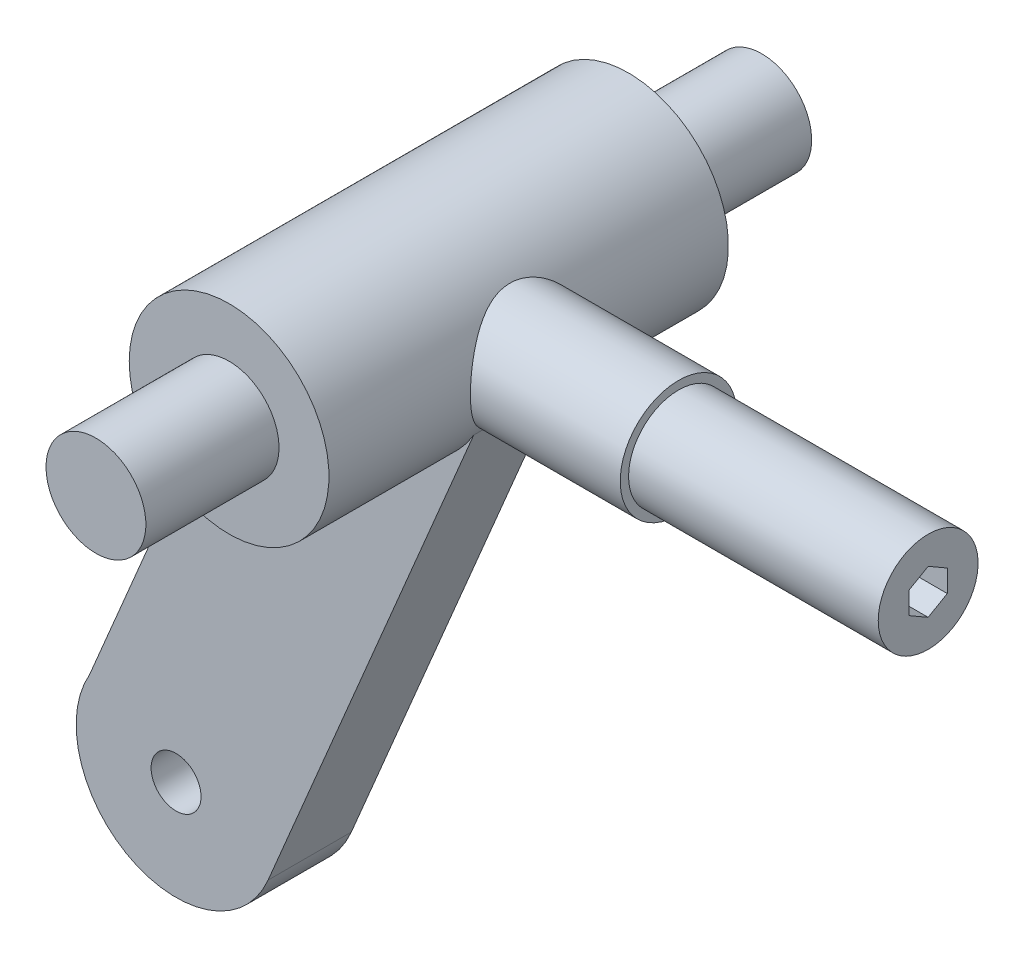
ISO-10303-21;
HEADER;
FILE_DESCRIPTION(('STEP AP214'),'2;1');
FILE_NAME('part.step','',(''),(''),'','','');
FILE_SCHEMA(('AUTOMOTIVE_DESIGN { 1 0 10303 214 1 1 1 1 }'));
ENDSEC;
DATA;
#1=APPLICATION_CONTEXT('core data for automotive mechanical design processes');
#2=APPLICATION_PROTOCOL_DEFINITION('international standard','automotive_design',2000,#1);
#3=PRODUCT_CONTEXT('',#1,'mechanical');
#4=PRODUCT('Part','Part','',(#3));
#5=PRODUCT_RELATED_PRODUCT_CATEGORY('part','',(#4));
#6=PRODUCT_DEFINITION_FORMATION('','',#4);
#7=PRODUCT_DEFINITION_CONTEXT('part definition',#1,'design');
#8=PRODUCT_DEFINITION('design','',#6,#7);
#9=PRODUCT_DEFINITION_SHAPE('','',#8);
#10=(LENGTH_UNIT() NAMED_UNIT(*) SI_UNIT(.MILLI.,.METRE.));
#11=(NAMED_UNIT(*) PLANE_ANGLE_UNIT() SI_UNIT($,.RADIAN.));
#12=(NAMED_UNIT(*) SI_UNIT($,.STERADIAN.) SOLID_ANGLE_UNIT());
#13=UNCERTAINTY_MEASURE_WITH_UNIT(LENGTH_MEASURE(1.E-05),#10,'distance_accuracy_value','');
#14=(GEOMETRIC_REPRESENTATION_CONTEXT(3) GLOBAL_UNCERTAINTY_ASSIGNED_CONTEXT((#13)) GLOBAL_UNIT_ASSIGNED_CONTEXT((#10,
#11,#12)) REPRESENTATION_CONTEXT('',''));
#15=CARTESIAN_POINT('',(0.,0.,0.));
#16=DIRECTION('',(0.,0.,1.));
#17=DIRECTION('',(1.,0.,0.));
#18=AXIS2_PLACEMENT_3D('',#15,#16,#17);
#19=CARTESIAN_POINT('',(3.31138823368356,0.,0.));
#20=DIRECTION('',(-1.,0.,0.));
#21=DIRECTION('',(0.,0.,1.));
#22=AXIS2_PLACEMENT_3D('',#19,#20,#21);
#23=CYLINDRICAL_SURFACE('',#22,3.);
#24=CARTESIAN_POINT('',(0.,0.,0.));
#25=DIRECTION('',(-1.,0.,0.));
#26=DIRECTION('',(0.,0.,1.));
#27=AXIS2_PLACEMENT_3D('',#24,#25,#26);
#28=CIRCLE('',#27,3.);
#29=CARTESIAN_POINT('',(0.,0.,3.));
#30=VERTEX_POINT('',#29);
#31=EDGE_CURVE('E11',#30,#30,#28,.T.);
#32=ORIENTED_EDGE('',*,*,#31,.F.);
#33=EDGE_LOOP('',(#32));
#34=FACE_BOUND('',#33,.T.);
#35=CARTESIAN_POINT('',(2.99999999999994,0.,0.));
#36=DIRECTION('',(-1.,0.,0.));
#37=DIRECTION('',(0.,0.,1.));
#38=AXIS2_PLACEMENT_3D('',#35,#36,#37);
#39=CIRCLE('',#38,3.);
#40=CARTESIAN_POINT('',(2.99999999999994,0.,3.));
#41=VERTEX_POINT('',#40);
#42=EDGE_CURVE('E55',#41,#41,#39,.T.);
#43=ORIENTED_EDGE('',*,*,#42,.T.);
#44=EDGE_LOOP('',(#43));
#45=FACE_BOUND('',#44,.T.);
#46=ADVANCED_FACE('F49',(#34,#45),#23,.T.);
#47=CARTESIAN_POINT('',(0.,0.,0.));
#48=DIRECTION('',(1.,0.,0.));
#49=DIRECTION('',(0.,0.,-1.));
#50=AXIS2_PLACEMENT_3D('',#47,#48,#49);
#51=PLANE('',#50);
#52=ORIENTED_EDGE('',*,*,#31,.T.);
#53=EDGE_LOOP('',(#52));
#54=FACE_BOUND('',#53,.T.);
#55=ADVANCED_FACE('F64',(#54),#51,.F.);
#56=CARTESIAN_POINT('',(2.99999999999996,0.,0.));
#57=DIRECTION('',(1.,0.,0.));
#58=DIRECTION('',(0.,0.,-1.));
#59=AXIS2_PLACEMENT_3D('',#56,#57,#58);
#60=PLANE('',#59);
#61=ORIENTED_EDGE('',*,*,#42,.F.);
#62=EDGE_LOOP('',(#61));
#63=FACE_BOUND('',#62,.T.);
#64=ADVANCED_FACE('F62',(#63),#60,.T.);
#65=CLOSED_SHELL('',(#46,#55,#64));
#66=MANIFOLD_SOLID_BREP('B2',#65);
#67=CARTESIAN_POINT('',(30.,0.,0.));
#68=DIRECTION('',(1.,0.,0.));
#69=DIRECTION('',(0.,0.,-1.));
#70=AXIS2_PLACEMENT_3D('',#67,#68,#69);
#71=PLANE('',#70);
#72=CARTESIAN_POINT('',(30.,0.,0.));
#73=DIRECTION('',(-1.,0.,0.));
#74=DIRECTION('',(0.,0.,1.));
#75=AXIS2_PLACEMENT_3D('',#72,#73,#74);
#76=CIRCLE('',#75,3.);
#77=CARTESIAN_POINT('',(30.,0.,3.));
#78=VERTEX_POINT('',#77);
#79=EDGE_CURVE('E242',#78,#78,#76,.T.);
#80=ORIENTED_EDGE('',*,*,#79,.F.);
#81=EDGE_LOOP('',(#80));
#82=FACE_BOUND('',#81,.T.);
#83=DIRECTION('',(0.,0.5,0.866025403784439));
#84=VECTOR('',#83,1.);
#85=CARTESIAN_POINT('',(30.,0.995207119104028,-0.574583098114143));
#86=LINE('',#85,#84);
#87=CARTESIAN_POINT('',(30.,0.663471412736019,-1.14916619622829));
#88=VERTEX_POINT('',#87);
#89=CARTESIAN_POINT('',(30.,1.32694282547204,0.));
#90=VERTEX_POINT('',#89);
#91=EDGE_CURVE('E251',#88,#90,#86,.T.);
#92=ORIENTED_EDGE('',*,*,#91,.F.);
#93=DIRECTION('',(0.,1.,0.));
#94=VECTOR('',#93,1.);
#95=CARTESIAN_POINT('',(30.,0.,-1.14916619622829));
#96=LINE('',#95,#94);
#97=CARTESIAN_POINT('',(30.,-0.663471412736019,-1.14916619622829));
#98=VERTEX_POINT('',#97);
#99=EDGE_CURVE('E255',#98,#88,#96,.T.);
#100=ORIENTED_EDGE('',*,*,#99,.F.);
#101=DIRECTION('',(0.,0.5,-0.866025403784439));
#102=VECTOR('',#101,1.);
#103=CARTESIAN_POINT('',(30.,-0.995207119104029,-0.574583098114143));
#104=LINE('',#103,#102);
#105=CARTESIAN_POINT('',(30.,-1.32694282547204,0.));
#106=VERTEX_POINT('',#105);
#107=EDGE_CURVE('E215',#106,#98,#104,.T.);
#108=ORIENTED_EDGE('',*,*,#107,.F.);
#109=DIRECTION('',(0.,-0.5,-0.866025403784439));
#110=VECTOR('',#109,1.);
#111=CARTESIAN_POINT('',(30.,-0.995207119104028,0.574583098114142));
#112=LINE('',#111,#110);
#113=CARTESIAN_POINT('',(30.,-0.663471412736018,1.14916619622829));
#114=VERTEX_POINT('',#113);
#115=EDGE_CURVE('E113',#114,#106,#112,.T.);
#116=ORIENTED_EDGE('',*,*,#115,.F.);
#117=DIRECTION('',(0.,-1.,0.));
#118=VECTOR('',#117,1.);
#119=CARTESIAN_POINT('',(30.,0.,1.14916619622829));
#120=LINE('',#119,#118);
#121=CARTESIAN_POINT('',(30.,0.663471412736019,1.14916619622828));
#122=VERTEX_POINT('',#121);
#123=EDGE_CURVE('E243',#122,#114,#120,.T.);
#124=ORIENTED_EDGE('',*,*,#123,.F.);
#125=DIRECTION('',(0.,-0.5,0.866025403784439));
#126=VECTOR('',#125,1.);
#127=CARTESIAN_POINT('',(30.,0.995207119104028,0.574583098114143));
#128=LINE('',#127,#126);
#129=EDGE_CURVE('E247',#90,#122,#128,.T.);
#130=ORIENTED_EDGE('',*,*,#129,.F.);
#131=EDGE_LOOP('',(#92,#100,#108,#116,#124,#130));
#132=FACE_BOUND('',#131,.T.);
#133=ADVANCED_FACE('F90',(#82,#132),#71,.T.);
#134=CARTESIAN_POINT('',(0.,0.,-20.));
#135=DIRECTION('',(0.,0.,-1.));
#136=DIRECTION('',(-1.,0.,0.));
#137=AXIS2_PLACEMENT_3D('',#134,#135,#136);
#138=CYLINDRICAL_SURFACE('',#137,5.99999999999997);
#139=DIRECTION('',(0.,0.,-1.));
#140=VECTOR('',#139,1.);
#141=CARTESIAN_POINT('',(5.19878742225396,-2.99543141103468,2.5));
#142=LINE('',#141,#140);
#143=CARTESIAN_POINT('',(5.19878742225396,-2.99543141103468,2.5));
#144=VERTEX_POINT('',#143);
#145=CARTESIAN_POINT('',(5.19878742225396,-2.99543141103468,1.81035650129658));
#146=VERTEX_POINT('',#145);
#147=EDGE_CURVE('E207',#144,#146,#142,.T.);
#148=ORIENTED_EDGE('',*,*,#147,.T.);
#149=CARTESIAN_POINT('',(5.99999999999997,0.,3.5));
#150=CARTESIAN_POINT('',(5.99999940705529,0.0899621842017,3.499999344979));
#151=CARTESIAN_POINT('',(5.99797113274333,0.179959123472136,3.49652549070914));
#152=CARTESIAN_POINT('',(5.9899069974074,0.359279181505375,3.48267375145587));
#153=CARTESIAN_POINT('',(5.98386839889509,0.448601797816938,3.47229115048177));
#154=CARTESIAN_POINT('',(5.96791503780682,0.626048243263435,3.44472607587532));
#155=CARTESIAN_POINT('',(5.95799184607169,0.714169031319306,3.42752881414367));
#156=CARTESIAN_POINT('',(5.93451883712603,0.888388196147667,3.38656029192718));
#157=CARTESIAN_POINT('',(5.92096745701799,0.974485683925672,3.36278619822453));
#158=CARTESIAN_POINT('',(5.87549044108278,1.22795193693791,3.28228254868244));
#159=CARTESIAN_POINT('',(5.83863857796368,1.39157911080687,3.21619899902307));
#160=CARTESIAN_POINT('',(5.75498500284208,1.70485306237609,3.06170731941832));
#161=CARTESIAN_POINT('',(5.70818668937317,1.85450459024161,2.97330681286644));
#162=CARTESIAN_POINT('',(5.60455210541235,2.14825204388916,2.76934942490433));
#163=CARTESIAN_POINT('',(5.54722907494984,2.29111541335043,2.65226606318091));
#164=CARTESIAN_POINT('',(5.43010305440727,2.55637666788825,2.39766667401416));
#165=CARTESIAN_POINT('',(5.37029705995943,2.67874880147822,2.26012534051895));
#166=CARTESIAN_POINT('',(5.24687865780901,2.91372645980217,1.9499418739621));
#167=CARTESIAN_POINT('',(5.18361328174861,3.023613987063,1.77508434232938));
#168=CARTESIAN_POINT('',(5.06905701564851,3.21198955709959,1.40567797214929));
#169=CARTESIAN_POINT('',(5.01774741841727,3.29052679284978,1.21116058858183));
#170=CARTESIAN_POINT('',(4.94524723148705,3.3981959438312,0.853622661771461));
#171=CARTESIAN_POINT('',(4.91984581185323,3.43453185280106,0.693627748220048));
#172=CARTESIAN_POINT('',(4.88464999348728,3.48441762747016,0.368510773523086));
#173=CARTESIAN_POINT('',(4.87483780508291,3.4979934668325,0.203394776092037));
#174=CARTESIAN_POINT('',(4.87225207387584,3.50159501400216,-0.127492341510743));
#175=CARTESIAN_POINT('',(4.87950571853601,3.49158314435522,-0.293264086437549));
#176=CARTESIAN_POINT('',(4.91001053927532,3.44854447624329,-0.620316048718743));
#177=CARTESIAN_POINT('',(4.93327315695059,3.41550121705183,-0.781592967793281));
#178=CARTESIAN_POINT('',(4.99243522012915,3.32840818064217,-1.09448992259878));
#179=CARTESIAN_POINT('',(5.02824040676163,3.27451478757804,-1.24617229202273));
#180=CARTESIAN_POINT('',(5.10862226659791,3.14763556587526,-1.53878459523282));
#181=CARTESIAN_POINT('',(5.15320223753607,3.07464255582214,-1.67971045879673));
#182=CARTESIAN_POINT('',(5.25508726886632,2.89760539824611,-1.97171937004038));
#183=CARTESIAN_POINT('',(5.31327541003331,2.7904154385322,-2.12059046379416));
#184=CARTESIAN_POINT('',(5.43069826274642,2.55439792135507,-2.39969384846331));
#185=CARTESIAN_POINT('',(5.48993387059697,2.42555094218621,-2.52990921328398));
#186=CARTESIAN_POINT('',(5.61148764416559,2.13062710418621,-2.78438595496094));
#187=CARTESIAN_POINT('',(5.67327691399839,1.96191474322218,-2.90590577058856));
#188=CARTESIAN_POINT('',(5.75704001227156,1.69274613625395,-3.06521152036507));
#189=CARTESIAN_POINT('',(5.78348329258611,1.60029853664454,-3.11449999867862));
#190=CARTESIAN_POINT('',(5.83265675908537,1.41056352156909,-3.20489156149222));
#191=CARTESIAN_POINT('',(5.85538921272543,1.31327910935178,-3.24599964791056));
#192=CARTESIAN_POINT('',(5.89507604633967,1.12118402811537,-3.31703609991152));
#193=CARTESIAN_POINT('',(5.91231421426123,1.02663935486808,-3.34752628148385));
#194=CARTESIAN_POINT('',(5.94244994910543,0.834695284408387,-3.40046848495027));
#195=CARTESIAN_POINT('',(5.95534989234229,0.73729748192204,-3.42292490786274));
#196=CARTESIAN_POINT('',(5.97642417050808,0.540500524879281,-3.45946074437019));
#197=CARTESIAN_POINT('',(5.98460150264117,0.441102681196741,-3.47354547122639));
#198=CARTESIAN_POINT('',(5.99598613235846,0.241187521473643,-3.49312375299983));
#199=CARTESIAN_POINT('',(5.99919404224351,0.140670344887641,-3.49861836633743));
#200=CARTESIAN_POINT('',(6.00045229485499,-0.0476500287328541,-3.50077534614502));
#201=CARTESIAN_POINT('',(5.99910862745505,-0.13543859084843,-3.49847544179336));
#202=CARTESIAN_POINT('',(5.99260403927111,-0.310461993330533,-3.48730817050794));
#203=CARTESIAN_POINT('',(5.98744193105941,-0.397696652936138,-3.47843876064159));
#204=CARTESIAN_POINT('',(5.96638262286712,-0.657520099512271,-3.44211487885189));
#205=CARTESIAN_POINT('',(5.94491336191049,-0.828422689977253,-3.40494664647616));
#206=CARTESIAN_POINT('',(5.88951843760437,-1.15808876666691,-3.30726440057742));
#207=CARTESIAN_POINT('',(5.85579439314151,-1.31700110317443,-3.24712749885318));
#208=CARTESIAN_POINT('',(5.77859485954364,-1.62255442838772,-3.10574691200883));
#209=CARTESIAN_POINT('',(5.73511720898609,-1.76919268722312,-3.0244985479054));
#210=CARTESIAN_POINT('',(5.63670505849234,-2.0625033084342,-2.8336931482093));
#211=CARTESIAN_POINT('',(5.58104858397802,-2.20758407137201,-2.72206739494686));
#212=CARTESIAN_POINT('',(5.46632933394453,-2.47807930325939,-2.47837093630279));
#213=CARTESIAN_POINT('',(5.40726264985702,-2.60347056780367,-2.34627646692488));
#214=CARTESIAN_POINT('',(5.28383495589227,-2.8463608155606,-2.04687887108909));
#215=CARTESIAN_POINT('',(5.21968488278057,-2.96112553039477,-1.87725460200967));
#216=CARTESIAN_POINT('',(5.10151027475491,-3.16038820338437,-1.51789928053921));
#217=CARTESIAN_POINT('',(5.04747329459452,-3.24492348040676,-1.32819339710366));
#218=CARTESIAN_POINT('',(4.96776744065975,-3.36531429748044,-0.975452204253678));
#219=CARTESIAN_POINT('',(4.93849487756631,-3.40773412765483,-0.815477783475593));
#220=CARTESIAN_POINT('',(4.89523317923759,-3.46960492167826,-0.489209064892347));
#221=CARTESIAN_POINT('',(4.88122503179366,-3.489084460678,-0.322922896423289));
#222=CARTESIAN_POINT('',(4.87053514207995,-3.50399594756399,0.0117532202430811));
#223=CARTESIAN_POINT('',(4.87389986973789,-3.49936339883644,0.180147607673535));
#224=CARTESIAN_POINT('',(4.89753765573743,-3.46619534757535,0.513387819359799));
#225=CARTESIAN_POINT('',(4.9178210182451,-3.43764527821144,0.678231418256455));
#226=CARTESIAN_POINT('',(4.97157869971421,-3.35939658034854,0.995161348999715));
#227=CARTESIAN_POINT('',(5.00464806903075,-3.31034376760202,1.14748017565883));
#228=CARTESIAN_POINT('',(5.08026146937035,-3.19308606788782,1.44199861353434));
#229=CARTESIAN_POINT('',(5.12280908648054,-3.12487392945044,1.58419436775333));
#230=CARTESIAN_POINT('',(5.22059857811579,-2.95904753922134,1.87795620125289));
#231=CARTESIAN_POINT('',(5.27678588540068,-2.8585152484814,2.02756049479071));
#232=CARTESIAN_POINT('',(5.39128042536149,-2.6362423687887,2.30921697519904));
#233=CARTESIAN_POINT('',(5.44958929089823,-2.51448515863008,2.44125526220363));
#234=CARTESIAN_POINT('',(5.57143917603492,-2.23286219445597,2.70299413509765));
#235=CARTESIAN_POINT('',(5.63456802501056,-2.07004703111803,2.82977305151313));
#236=CARTESIAN_POINT('',(5.72147203378951,-1.80920666729131,2.9979192430271));
#237=CARTESIAN_POINT('',(5.74916078272631,-1.71941205496245,3.05033058248405));
#238=CARTESIAN_POINT('',(5.80117891858138,-1.53476261972516,3.14727760192881));
#239=CARTESIAN_POINT('',(5.82551026170157,-1.43991078846993,3.19181787230002));
#240=CARTESIAN_POINT('',(5.86904784303835,-1.25031817720424,3.27058817523678));
#241=CARTESIAN_POINT('',(5.88844069632124,-1.15578010730153,3.30520328441334));
#242=CARTESIAN_POINT('',(5.92295472951738,-0.963403250723181,3.36630793151273));
#243=CARTESIAN_POINT('',(5.93807839302153,-0.865566420334712,3.39280219449155));
#244=CARTESIAN_POINT('',(5.96356695531814,-0.667677878357174,3.43721698560877));
#245=CARTESIAN_POINT('',(5.97394622618967,-0.56763383139994,3.45516341453391));
#246=CARTESIAN_POINT('',(5.98967652486907,-0.366031363492469,3.4822906809512));
#247=CARTESIAN_POINT('',(5.9950320468426,-0.264474378789174,3.49147935311125));
#248=CARTESIAN_POINT('',(5.9985289781034,-0.1356008428426,3.49747764565677));
#249=CARTESIAN_POINT('',(5.99908033765354,-0.108493391182496,3.4984232282245));
#250=CARTESIAN_POINT('',(5.99981593957895,-0.0542583467885981,3.49968450685542));
#251=CARTESIAN_POINT('',(6.00000017881996,-0.0271307538848262,3.50000019754093));
#252=CARTESIAN_POINT('',(5.99999999999997,0.,3.5));
#253=B_SPLINE_CURVE_WITH_KNOTS('',3,(#149,#150,#151,#152,#153,#154,#155,#156,#157,#158,#159,
#160,#161,#162,#163,#164,#165,#166,#167,#168,#169,#170,#171,#172,#173,#174,#175,#176,#177,#178,
#179,#180,#181,#182,#183,#184,#185,#186,#187,#188,#189,#190,#191,#192,#193,#194,#195,#196,#197,
#198,#199,#200,#201,#202,#203,#204,#205,#206,#207,#208,#209,#210,#211,#212,#213,#214,#215,#216,
#217,#218,#219,#220,#221,#222,#223,#224,#225,#226,#227,#228,#229,#230,#231,#232,#233,#234,#235,
#236,#237,#238,#239,#240,#241,#242,#243,#244,#245,#246,#247,#248,#249,#250,#251,#252),
.UNSPECIFIED.,.T.,.F.,(4,2,2,2,2,2,2,2,2,2,2,2,2,2,2,2,2,2,2,2,2,2,2,2,2,2,2,2,2,2,2,2,2,2,2,2,
2,2,2,2,2,2,2,2,2,2,2,2,2,2,2,4),(0.,0.269857022230553,0.539898441223979,0.81052909898963,
1.08127652312956,1.61950432452768,2.15754851740577,2.73544583741866,3.31406404167448,
3.9588634393916,4.60264704184033,5.09858348127047,5.59395357461926,6.09011337294359,
6.58662814492186,7.07948888602377,7.57253520864788,8.14762469114194,8.72323268451362,
9.37023224992073,9.69399877078183,10.0175667114708,10.3196086145674,10.6214848001053,
10.9231691888501,11.2248164029905,11.4879654567385,11.7511963768611,12.2770829521784,
12.7946826161502,13.3123970949539,13.8841084077748,14.4564885153885,15.0972759394319,
15.7372695446949,16.2393630156573,16.7408303993928,17.2436398295978,17.746755715859,
18.2350938681074,18.7236170974388,19.2878323305451,19.852491401133,20.4962952131074,
20.8187115384657,21.1409392065765,21.4480807758936,21.7550432963678,22.0610696775496,
22.3668220305958,22.4482046916946,22.5295880475924),.UNSPECIFIED.);
#254=CARTESIAN_POINT('',(5.198787422254,-2.99543141103469,-1.81035650129657));
#255=VERTEX_POINT('',#254);
#256=EDGE_CURVE('E280',#146,#255,#253,.T.);
#257=ORIENTED_EDGE('',*,*,#256,.T.);
#258=CARTESIAN_POINT('',(5.19878742225396,-2.99543141103468,-2.5));
#259=VERTEX_POINT('',#258);
#260=EDGE_CURVE('E106',#255,#259,#142,.T.);
#261=ORIENTED_EDGE('',*,*,#260,.T.);
#262=CARTESIAN_POINT('',(0.,0.,-2.5));
#263=DIRECTION('',(0.,0.,1.));
#264=DIRECTION('',(1.,0.,0.));
#265=AXIS2_PLACEMENT_3D('',#262,#263,#264);
#266=CIRCLE('',#265,5.99999999999993);
#267=CARTESIAN_POINT('',(-5.52947005879516,2.32915453950291,-2.5));
#268=VERTEX_POINT('',#267);
#269=EDGE_CURVE('E517',#268,#259,#266,.T.);
#270=ORIENTED_EDGE('',*,*,#269,.F.);
#271=DIRECTION('',(0.,0.,-1.));
#272=VECTOR('',#271,1.);
#273=CARTESIAN_POINT('',(-5.52947005879516,2.32915453950291,2.5));
#274=LINE('',#273,#272);
#275=CARTESIAN_POINT('',(-5.52947005879516,2.32915453950291,2.5));
#276=VERTEX_POINT('',#275);
#277=EDGE_CURVE('E528',#276,#268,#274,.T.);
#278=ORIENTED_EDGE('',*,*,#277,.F.);
#279=CARTESIAN_POINT('',(0.,0.,2.5));
#280=DIRECTION('',(0.,0.,1.));
#281=DIRECTION('',(1.,0.,0.));
#282=AXIS2_PLACEMENT_3D('',#279,#280,#281);
#283=CIRCLE('',#282,5.99999999999993);
#284=EDGE_CURVE('E191',#276,#144,#283,.T.);
#285=ORIENTED_EDGE('',*,*,#284,.T.);
#286=EDGE_LOOP('',(#148,#257,#261,#270,#278,#285));
#287=FACE_BOUND('',#286,.T.);
#288=CARTESIAN_POINT('',(0.,0.,-12.));
#289=DIRECTION('',(0.,0.,-1.));
#290=DIRECTION('',(-1.,0.,0.));
#291=AXIS2_PLACEMENT_3D('',#288,#289,#290);
#292=CIRCLE('',#291,6.);
#293=CARTESIAN_POINT('',(-6.00000000000001,0.,-12.));
#294=VERTEX_POINT('',#293);
#295=EDGE_CURVE('E297',#294,#294,#292,.T.);
#296=ORIENTED_EDGE('',*,*,#295,.F.);
#297=EDGE_LOOP('',(#296));
#298=FACE_BOUND('',#297,.T.);
#299=CARTESIAN_POINT('',(0.,0.,12.));
#300=DIRECTION('',(0.,0.,-1.));
#301=DIRECTION('',(-1.,0.,0.));
#302=AXIS2_PLACEMENT_3D('',#299,#300,#301);
#303=CIRCLE('',#302,5.99999999999994);
#304=CARTESIAN_POINT('',(-5.99999999999994,0.,12.));
#305=VERTEX_POINT('',#304);
#306=EDGE_CURVE('E99',#305,#305,#303,.T.);
#307=ORIENTED_EDGE('',*,*,#306,.T.);
#308=EDGE_LOOP('',(#307));
#309=FACE_BOUND('',#308,.T.);
#310=ADVANCED_FACE('F310',(#287,#298,#309),#138,.T.);
#311=CARTESIAN_POINT('',(0.,0.,12.));
#312=DIRECTION('',(0.,0.,-1.));
#313=DIRECTION('',(-1.,0.,0.));
#314=AXIS2_PLACEMENT_3D('',#311,#312,#313);
#315=PLANE('',#314);
#316=ORIENTED_EDGE('',*,*,#306,.F.);
#317=EDGE_LOOP('',(#316));
#318=FACE_BOUND('',#317,.T.);
#319=CARTESIAN_POINT('',(0.,0.,12.));
#320=DIRECTION('',(0.,0.,-1.));
#321=DIRECTION('',(-1.,0.,0.));
#322=AXIS2_PLACEMENT_3D('',#319,#320,#321);
#323=CIRCLE('',#322,2.99999999999998);
#324=CARTESIAN_POINT('',(-2.99999999999998,0.,12.));
#325=VERTEX_POINT('',#324);
#326=EDGE_CURVE('E281',#325,#325,#323,.T.);
#327=ORIENTED_EDGE('',*,*,#326,.T.);
#328=EDGE_LOOP('',(#327));
#329=FACE_BOUND('',#328,.T.);
#330=ADVANCED_FACE('F92',(#318,#329),#315,.F.);
#331=CARTESIAN_POINT('',(0.,0.,-12.));
#332=DIRECTION('',(0.,0.,-1.));
#333=DIRECTION('',(-1.,0.,0.));
#334=AXIS2_PLACEMENT_3D('',#331,#332,#333);
#335=PLANE('',#334);
#336=ORIENTED_EDGE('',*,*,#295,.T.);
#337=EDGE_LOOP('',(#336));
#338=FACE_BOUND('',#337,.T.);
#339=CARTESIAN_POINT('',(0.,0.,-12.));
#340=DIRECTION('',(0.,0.,-1.));
#341=DIRECTION('',(-1.,0.,0.));
#342=AXIS2_PLACEMENT_3D('',#339,#340,#341);
#343=CIRCLE('',#342,2.99999999999998);
#344=CARTESIAN_POINT('',(-2.99999999999998,0.,-12.));
#345=VERTEX_POINT('',#344);
#346=EDGE_CURVE('E293',#345,#345,#343,.T.);
#347=ORIENTED_EDGE('',*,*,#346,.F.);
#348=EDGE_LOOP('',(#347));
#349=FACE_BOUND('',#348,.T.);
#350=ADVANCED_FACE('F335',(#338,#349),#335,.T.);
#351=CARTESIAN_POINT('',(0.,0.,-20.));
#352=DIRECTION('',(0.,0.,-1.));
#353=DIRECTION('',(-1.,0.,0.));
#354=AXIS2_PLACEMENT_3D('',#351,#352,#353);
#355=CYLINDRICAL_SURFACE('',#354,2.99999999999999);
#356=CARTESIAN_POINT('',(0.,0.,-20.));
#357=DIRECTION('',(0.,0.,-1.));
#358=DIRECTION('',(-1.,0.,0.));
#359=AXIS2_PLACEMENT_3D('',#356,#357,#358);
#360=CIRCLE('',#359,3.);
#361=CARTESIAN_POINT('',(-3.00000000000001,0.,-20.));
#362=VERTEX_POINT('',#361);
#363=EDGE_CURVE('E289',#362,#362,#360,.T.);
#364=ORIENTED_EDGE('',*,*,#363,.F.);
#365=EDGE_LOOP('',(#364));
#366=FACE_BOUND('',#365,.T.);
#367=ORIENTED_EDGE('',*,*,#346,.T.);
#368=EDGE_LOOP('',(#367));
#369=FACE_BOUND('',#368,.T.);
#370=ADVANCED_FACE('F332',(#366,#369),#355,.T.);
#371=CARTESIAN_POINT('',(0.,0.,-20.));
#372=DIRECTION('',(0.,0.,1.));
#373=DIRECTION('',(1.,0.,0.));
#374=AXIS2_PLACEMENT_3D('',#371,#372,#373);
#375=PLANE('',#374);
#376=ORIENTED_EDGE('',*,*,#363,.T.);
#377=EDGE_LOOP('',(#376));
#378=FACE_BOUND('',#377,.T.);
#379=ADVANCED_FACE('F328',(#378),#375,.F.);
#380=CARTESIAN_POINT('',(0.,0.,20.));
#381=DIRECTION('',(0.,0.,-1.));
#382=DIRECTION('',(-1.,0.,0.));
#383=AXIS2_PLACEMENT_3D('',#380,#381,#382);
#384=PLANE('',#383);
#385=CARTESIAN_POINT('',(0.,0.,20.));
#386=DIRECTION('',(0.,0.,-1.));
#387=DIRECTION('',(-1.,0.,0.));
#388=AXIS2_PLACEMENT_3D('',#385,#386,#387);
#389=CIRCLE('',#388,3.00000000000001);
#390=CARTESIAN_POINT('',(-3.,0.,20.));
#391=VERTEX_POINT('',#390);
#392=EDGE_CURVE('E285',#391,#391,#389,.T.);
#393=ORIENTED_EDGE('',*,*,#392,.F.);
#394=EDGE_LOOP('',(#393));
#395=FACE_BOUND('',#394,.T.);
#396=ADVANCED_FACE('F324',(#395),#384,.F.);
#397=CARTESIAN_POINT('',(0.,0.,-20.));
#398=DIRECTION('',(0.,0.,-1.));
#399=DIRECTION('',(-1.,0.,0.));
#400=AXIS2_PLACEMENT_3D('',#397,#398,#399);
#401=CYLINDRICAL_SURFACE('',#400,3.);
#402=ORIENTED_EDGE('',*,*,#392,.T.);
#403=EDGE_LOOP('',(#402));
#404=FACE_BOUND('',#403,.T.);
#405=ORIENTED_EDGE('',*,*,#326,.F.);
#406=EDGE_LOOP('',(#405));
#407=FACE_BOUND('',#406,.T.);
#408=ADVANCED_FACE('F319',(#404,#407),#401,.T.);
#409=CARTESIAN_POINT('',(15.,0.,0.));
#410=DIRECTION('',(-1.,0.,0.));
#411=DIRECTION('',(0.,0.,1.));
#412=AXIS2_PLACEMENT_3D('',#409,#410,#411);
#413=CYLINDRICAL_SURFACE('',#412,3.5);
#414=ORIENTED_EDGE('',*,*,#256,.F.);
#415=CARTESIAN_POINT('',(6.46053992196841,0.,0.));
#416=DIRECTION('',(0.921578343132538,-0.388192423250489,0.));
#417=DIRECTION('',(-0.388192423250489,-0.921578343132538,0.));
#418=AXIS2_PLACEMENT_3D('',#415,#416,#417);
#419=ELLIPSE('',#418,3.79783230159592,3.5);
#420=EDGE_CURVE('E47',#146,#255,#419,.T.);
#421=ORIENTED_EDGE('',*,*,#420,.T.);
#422=EDGE_LOOP('',(#414,#421));
#423=FACE_BOUND('',#422,.T.);
#424=CARTESIAN_POINT('',(15.,0.,0.));
#425=DIRECTION('',(1.,0.,0.));
#426=DIRECTION('',(0.,0.,-1.));
#427=AXIS2_PLACEMENT_3D('',#424,#425,#426);
#428=CIRCLE('',#427,3.5);
#429=CARTESIAN_POINT('',(15.,0.,-3.5));
#430=VERTEX_POINT('',#429);
#431=EDGE_CURVE('E276',#430,#430,#428,.T.);
#432=ORIENTED_EDGE('',*,*,#431,.F.);
#433=EDGE_LOOP('',(#432));
#434=FACE_BOUND('',#433,.T.);
#435=ADVANCED_FACE('F313',(#423,#434),#413,.T.);
#436=CARTESIAN_POINT('',(15.,0.,0.));
#437=DIRECTION('',(1.,0.,0.));
#438=DIRECTION('',(0.,0.,-1.));
#439=AXIS2_PLACEMENT_3D('',#436,#437,#438);
#440=PLANE('',#439);
#441=CARTESIAN_POINT('',(15.,0.,0.));
#442=DIRECTION('',(1.,0.,0.));
#443=DIRECTION('',(0.,0.,-1.));
#444=AXIS2_PLACEMENT_3D('',#441,#442,#443);
#445=CIRCLE('',#444,3.);
#446=CARTESIAN_POINT('',(15.,0.,-3.));
#447=VERTEX_POINT('',#446);
#448=EDGE_CURVE('E275',#447,#447,#445,.F.);
#449=ORIENTED_EDGE('',*,*,#448,.T.);
#450=EDGE_LOOP('',(#449));
#451=FACE_BOUND('',#450,.T.);
#452=ORIENTED_EDGE('',*,*,#431,.T.);
#453=EDGE_LOOP('',(#452));
#454=FACE_BOUND('',#453,.T.);
#455=ADVANCED_FACE('F318',(#451,#454),#440,.T.);
#456=CARTESIAN_POINT('',(3.31138823368356,0.,0.));
#457=DIRECTION('',(-1.,0.,0.));
#458=DIRECTION('',(0.,0.,1.));
#459=AXIS2_PLACEMENT_3D('',#456,#457,#458);
#460=CYLINDRICAL_SURFACE('',#459,3.);
#461=ORIENTED_EDGE('',*,*,#448,.F.);
#462=EDGE_LOOP('',(#461));
#463=FACE_BOUND('',#462,.T.);
#464=ORIENTED_EDGE('',*,*,#79,.T.);
#465=EDGE_LOOP('',(#464));
#466=FACE_BOUND('',#465,.T.);
#467=ADVANCED_FACE('F356',(#463,#466),#460,.T.);
#468=CARTESIAN_POINT('',(33.5107607202004,0.,-1.14916619622829));
#469=DIRECTION('',(0.,0.,1.));
#470=DIRECTION('',(0.,-1.,0.));
#471=AXIS2_PLACEMENT_3D('',#468,#469,#470);
#472=PLANE('',#471);
#473=ORIENTED_EDGE('',*,*,#99,.T.);
#474=DIRECTION('',(-1.,0.,0.));
#475=VECTOR('',#474,1.);
#476=CARTESIAN_POINT('',(33.5107607202004,0.663471412736019,-1.14916619622829));
#477=LINE('',#476,#475);
#478=CARTESIAN_POINT('',(5.,0.663471412736019,-1.14916619622829));
#479=VERTEX_POINT('',#478);
#480=EDGE_CURVE('E236',#88,#479,#477,.T.);
#481=ORIENTED_EDGE('',*,*,#480,.T.);
#482=DIRECTION('',(0.,1.,0.));
#483=VECTOR('',#482,1.);
#484=CARTESIAN_POINT('',(5.,0.,-1.14916619622829));
#485=LINE('',#484,#483);
#486=CARTESIAN_POINT('',(5.,-0.663471412736019,-1.14916619622829));
#487=VERTEX_POINT('',#486);
#488=EDGE_CURVE('E205',#487,#479,#485,.T.);
#489=ORIENTED_EDGE('',*,*,#488,.F.);
#490=DIRECTION('',(-1.,0.,0.));
#491=VECTOR('',#490,1.);
#492=CARTESIAN_POINT('',(33.5107607202004,-0.663471412736019,-1.14916619622829));
#493=LINE('',#492,#491);
#494=EDGE_CURVE('E201',#98,#487,#493,.T.);
#495=ORIENTED_EDGE('',*,*,#494,.F.);
#496=EDGE_LOOP('',(#473,#481,#489,#495));
#497=FACE_BOUND('',#496,.T.);
#498=ADVANCED_FACE('F354',(#497),#472,.T.);
#499=CARTESIAN_POINT('',(33.5107607202004,0.995207119104028,-0.574583098114143));
#500=DIRECTION('',(0.,-0.866025403784439,0.5));
#501=DIRECTION('',(0.,-0.5,-0.866025403784439));
#502=AXIS2_PLACEMENT_3D('',#499,#500,#501);
#503=PLANE('',#502);
#504=ORIENTED_EDGE('',*,*,#91,.T.);
#505=DIRECTION('',(-1.,0.,0.));
#506=VECTOR('',#505,1.);
#507=CARTESIAN_POINT('',(33.5107607202004,1.32694282547204,0.));
#508=LINE('',#507,#506);
#509=CARTESIAN_POINT('',(5.,1.32694282547204,0.));
#510=VERTEX_POINT('',#509);
#511=EDGE_CURVE('E231',#90,#510,#508,.T.);
#512=ORIENTED_EDGE('',*,*,#511,.T.);
#513=DIRECTION('',(0.,0.5,0.866025403784439));
#514=VECTOR('',#513,1.);
#515=CARTESIAN_POINT('',(5.,0.995207119104028,-0.574583098114143));
#516=LINE('',#515,#514);
#517=EDGE_CURVE('E232',#479,#510,#516,.T.);
#518=ORIENTED_EDGE('',*,*,#517,.F.);
#519=ORIENTED_EDGE('',*,*,#480,.F.);
#520=EDGE_LOOP('',(#504,#512,#518,#519));
#521=FACE_BOUND('',#520,.T.);
#522=ADVANCED_FACE('F363',(#521),#503,.T.);
#523=CARTESIAN_POINT('',(33.5107607202004,0.995207119104028,0.574583098114143));
#524=DIRECTION('',(0.,-0.866025403784439,-0.5));
#525=DIRECTION('',(0.,0.5,-0.866025403784439));
#526=AXIS2_PLACEMENT_3D('',#523,#524,#525);
#527=PLANE('',#526);
#528=ORIENTED_EDGE('',*,*,#129,.T.);
#529=DIRECTION('',(-1.,0.,0.));
#530=VECTOR('',#529,1.);
#531=CARTESIAN_POINT('',(33.5107607202004,0.663471412736019,1.14916619622828));
#532=LINE('',#531,#530);
#533=CARTESIAN_POINT('',(5.,0.663471412736019,1.14916619622828));
#534=VERTEX_POINT('',#533);
#535=EDGE_CURVE('E226',#122,#534,#532,.T.);
#536=ORIENTED_EDGE('',*,*,#535,.T.);
#537=DIRECTION('',(0.,-0.5,0.866025403784439));
#538=VECTOR('',#537,1.);
#539=CARTESIAN_POINT('',(5.,0.995207119104028,0.574583098114143));
#540=LINE('',#539,#538);
#541=EDGE_CURVE('E227',#510,#534,#540,.T.);
#542=ORIENTED_EDGE('',*,*,#541,.F.);
#543=ORIENTED_EDGE('',*,*,#511,.F.);
#544=EDGE_LOOP('',(#528,#536,#542,#543));
#545=FACE_BOUND('',#544,.T.);
#546=ADVANCED_FACE('F456',(#545),#527,.T.);
#547=CARTESIAN_POINT('',(33.5107607202004,0.,1.14916619622829));
#548=DIRECTION('',(0.,0.,-1.));
#549=DIRECTION('',(0.,1.,0.));
#550=AXIS2_PLACEMENT_3D('',#547,#548,#549);
#551=PLANE('',#550);
#552=ORIENTED_EDGE('',*,*,#123,.T.);
#553=DIRECTION('',(-1.,0.,0.));
#554=VECTOR('',#553,1.);
#555=CARTESIAN_POINT('',(33.5107607202004,-0.663471412736018,1.14916619622829));
#556=LINE('',#555,#554);
#557=CARTESIAN_POINT('',(5.,-0.663471412736018,1.14916619622829));
#558=VERTEX_POINT('',#557);
#559=EDGE_CURVE('E221',#114,#558,#556,.T.);
#560=ORIENTED_EDGE('',*,*,#559,.T.);
#561=DIRECTION('',(0.,-1.,0.));
#562=VECTOR('',#561,1.);
#563=CARTESIAN_POINT('',(5.,0.,1.14916619622829));
#564=LINE('',#563,#562);
#565=EDGE_CURVE('E222',#534,#558,#564,.T.);
#566=ORIENTED_EDGE('',*,*,#565,.F.);
#567=ORIENTED_EDGE('',*,*,#535,.F.);
#568=EDGE_LOOP('',(#552,#560,#566,#567));
#569=FACE_BOUND('',#568,.T.);
#570=ADVANCED_FACE('F447',(#569),#551,.T.);
#571=CARTESIAN_POINT('',(33.5107607202004,-0.995207119104028,0.574583098114142));
#572=DIRECTION('',(0.,0.866025403784439,-0.5));
#573=DIRECTION('',(0.,0.5,0.866025403784439));
#574=AXIS2_PLACEMENT_3D('',#571,#572,#573);
#575=PLANE('',#574);
#576=ORIENTED_EDGE('',*,*,#115,.T.);
#577=DIRECTION('',(-1.,0.,0.));
#578=VECTOR('',#577,1.);
#579=CARTESIAN_POINT('',(33.5107607202004,-1.32694282547204,0.));
#580=LINE('',#579,#578);
#581=CARTESIAN_POINT('',(5.,-1.32694282547204,0.));
#582=VERTEX_POINT('',#581);
#583=EDGE_CURVE('E216',#106,#582,#580,.T.);
#584=ORIENTED_EDGE('',*,*,#583,.T.);
#585=DIRECTION('',(0.,-0.5,-0.866025403784439));
#586=VECTOR('',#585,1.);
#587=CARTESIAN_POINT('',(5.,-0.995207119104028,0.574583098114142));
#588=LINE('',#587,#586);
#589=EDGE_CURVE('E217',#558,#582,#588,.T.);
#590=ORIENTED_EDGE('',*,*,#589,.F.);
#591=ORIENTED_EDGE('',*,*,#559,.F.);
#592=EDGE_LOOP('',(#576,#584,#590,#591));
#593=FACE_BOUND('',#592,.T.);
#594=ADVANCED_FACE('F437',(#593),#575,.T.);
#595=CARTESIAN_POINT('',(33.5107607202004,-0.995207119104029,-0.574583098114143));
#596=DIRECTION('',(0.,0.866025403784439,0.5));
#597=DIRECTION('',(0.,-0.5,0.866025403784439));
#598=AXIS2_PLACEMENT_3D('',#595,#596,#597);
#599=PLANE('',#598);
#600=ORIENTED_EDGE('',*,*,#107,.T.);
#601=ORIENTED_EDGE('',*,*,#494,.T.);
#602=DIRECTION('',(0.,0.5,-0.866025403784439));
#603=VECTOR('',#602,1.);
#604=CARTESIAN_POINT('',(5.,-0.995207119104029,-0.574583098114143));
#605=LINE('',#604,#603);
#606=EDGE_CURVE('E211',#582,#487,#605,.T.);
#607=ORIENTED_EDGE('',*,*,#606,.F.);
#608=ORIENTED_EDGE('',*,*,#583,.F.);
#609=EDGE_LOOP('',(#600,#601,#607,#608));
#610=FACE_BOUND('',#609,.T.);
#611=ADVANCED_FACE('F425',(#610),#599,.T.);
#612=CARTESIAN_POINT('',(5.,0.,0.));
#613=DIRECTION('',(1.,0.,0.));
#614=DIRECTION('',(0.,0.,-1.));
#615=AXIS2_PLACEMENT_3D('',#612,#613,#614);
#616=PLANE('',#615);
#617=ORIENTED_EDGE('',*,*,#488,.T.);
#618=ORIENTED_EDGE('',*,*,#517,.T.);
#619=ORIENTED_EDGE('',*,*,#541,.T.);
#620=ORIENTED_EDGE('',*,*,#565,.T.);
#621=ORIENTED_EDGE('',*,*,#589,.T.);
#622=ORIENTED_EDGE('',*,*,#606,.T.);
#623=EDGE_LOOP('',(#617,#618,#619,#620,#621,#622));
#624=FACE_BOUND('',#623,.T.);
#625=ADVANCED_FACE('F420',(#624),#616,.T.);
#626=CARTESIAN_POINT('',(-5.52947005879516,2.3291545395029,2.5));
#627=DIRECTION('',(0.921578343132538,-0.388192423250489,0.));
#628=DIRECTION('',(0.388192423250489,0.921578343132538,0.));
#629=AXIS2_PLACEMENT_3D('',#626,#627,#628);
#630=PLANE('',#629);
#631=DIRECTION('',(-0.388192423250489,-0.921578343132538,0.));
#632=VECTOR('',#631,1.);
#633=CARTESIAN_POINT('',(-5.52947005879516,2.3291545395029,-2.5));
#634=LINE('',#633,#632);
#635=CARTESIAN_POINT('',(-17.8855862252113,-27.0045685889653,-2.5));
#636=VERTEX_POINT('',#635);
#637=EDGE_CURVE('E199',#268,#636,#634,.T.);
#638=ORIENTED_EDGE('',*,*,#637,.T.);
#639=DIRECTION('',(0.,0.,-1.));
#640=VECTOR('',#639,1.);
#641=CARTESIAN_POINT('',(-17.8855862252113,-27.0045685889653,2.5));
#642=LINE('',#641,#640);
#643=CARTESIAN_POINT('',(-17.8855862252113,-27.0045685889653,2.5));
#644=VERTEX_POINT('',#643);
#645=EDGE_CURVE('E178',#644,#636,#642,.T.);
#646=ORIENTED_EDGE('',*,*,#645,.F.);
#647=DIRECTION('',(-0.388192423250489,-0.921578343132538,0.));
#648=VECTOR('',#647,1.);
#649=CARTESIAN_POINT('',(-5.52947005879516,2.3291545395029,2.5));
#650=LINE('',#649,#648);
#651=EDGE_CURVE('E186',#276,#644,#650,.T.);
#652=ORIENTED_EDGE('',*,*,#651,.F.);
#653=ORIENTED_EDGE('',*,*,#277,.T.);
#654=EDGE_LOOP('',(#638,#646,#652,#653));
#655=FACE_BOUND('',#654,.T.);
#656=ADVANCED_FACE('F197',(#655),#630,.F.);
#657=CARTESIAN_POINT('',(-12.6867988029574,-30.,2.5));
#658=DIRECTION('',(0.,0.,-1.));
#659=DIRECTION('',(-1.,0.,0.));
#660=AXIS2_PLACEMENT_3D('',#657,#658,#659);
#661=CYLINDRICAL_SURFACE('',#660,5.99999999999993);
#662=CARTESIAN_POINT('',(-12.6867988029574,-30.,-2.5));
#663=DIRECTION('',(0.,0.,1.));
#664=DIRECTION('',(1.,0.,0.));
#665=AXIS2_PLACEMENT_3D('',#662,#663,#664);
#666=CIRCLE('',#665,5.99999999999993);
#667=CARTESIAN_POINT('',(-7.15732874416221,-32.3291545395029,-2.5));
#668=VERTEX_POINT('',#667);
#669=EDGE_CURVE('E535',#636,#668,#666,.T.);
#670=ORIENTED_EDGE('',*,*,#669,.T.);
#671=DIRECTION('',(0.,0.,-1.));
#672=VECTOR('',#671,1.);
#673=CARTESIAN_POINT('',(-7.15732874416221,-32.3291545395029,2.5));
#674=LINE('',#673,#672);
#675=CARTESIAN_POINT('',(-7.15732874416221,-32.3291545395029,2.5));
#676=VERTEX_POINT('',#675);
#677=EDGE_CURVE('E180',#676,#668,#674,.T.);
#678=ORIENTED_EDGE('',*,*,#677,.F.);
#679=CARTESIAN_POINT('',(-12.6867988029574,-30.,2.5));
#680=DIRECTION('',(0.,0.,1.));
#681=DIRECTION('',(1.,0.,0.));
#682=AXIS2_PLACEMENT_3D('',#679,#680,#681);
#683=CIRCLE('',#682,5.99999999999993);
#684=EDGE_CURVE('E173',#644,#676,#683,.T.);
#685=ORIENTED_EDGE('',*,*,#684,.F.);
#686=ORIENTED_EDGE('',*,*,#645,.T.);
#687=EDGE_LOOP('',(#670,#678,#685,#686));
#688=FACE_BOUND('',#687,.T.);
#689=ADVANCED_FACE('F176',(#688),#661,.T.);
#690=CARTESIAN_POINT('',(5.48697947006392,-2.31125641426175,2.5));
#691=DIRECTION('',(0.921578343132538,-0.388192423250489,0.));
#692=DIRECTION('',(0.388192423250489,0.921578343132538,0.));
#693=AXIS2_PLACEMENT_3D('',#690,#691,#692);
#694=PLANE('',#693);
#695=ORIENTED_EDGE('',*,*,#420,.F.);
#696=ORIENTED_EDGE('',*,*,#147,.F.);
#697=DIRECTION('',(-0.388192423250489,-0.921578343132538,0.));
#698=VECTOR('',#697,1.);
#699=CARTESIAN_POINT('',(5.48697947006392,-2.31125641426175,2.5));
#700=LINE('',#699,#698);
#701=EDGE_CURVE('E185',#144,#676,#700,.T.);
#702=ORIENTED_EDGE('',*,*,#701,.T.);
#703=ORIENTED_EDGE('',*,*,#677,.T.);
#704=DIRECTION('',(-0.388192423250489,-0.921578343132538,0.));
#705=VECTOR('',#704,1.);
#706=CARTESIAN_POINT('',(5.48697947006392,-2.31125641426175,-2.5));
#707=LINE('',#706,#705);
#708=EDGE_CURVE('E521',#259,#668,#707,.T.);
#709=ORIENTED_EDGE('',*,*,#708,.F.);
#710=ORIENTED_EDGE('',*,*,#260,.F.);
#711=EDGE_LOOP('',(#695,#696,#702,#703,#709,#710));
#712=FACE_BOUND('',#711,.T.);
#713=ADVANCED_FACE('F499',(#712),#694,.T.);
#714=CARTESIAN_POINT('',(-12.6867988029574,-30.,2.5));
#715=DIRECTION('',(0.,0.,-1.));
#716=DIRECTION('',(-1.,0.,0.));
#717=AXIS2_PLACEMENT_3D('',#714,#715,#716);
#718=CYLINDRICAL_SURFACE('',#717,1.5);
#719=CARTESIAN_POINT('',(-12.6867988029574,-30.,2.5));
#720=DIRECTION('',(0.,0.,1.));
#721=DIRECTION('',(1.,0.,0.));
#722=AXIS2_PLACEMENT_3D('',#719,#720,#721);
#723=CIRCLE('',#722,1.5);
#724=CARTESIAN_POINT('',(-11.1867988029574,-30.,2.5));
#725=VERTEX_POINT('',#724);
#726=EDGE_CURVE('E195',#725,#725,#723,.T.);
#727=ORIENTED_EDGE('',*,*,#726,.T.);
#728=EDGE_LOOP('',(#727));
#729=FACE_BOUND('',#728,.T.);
#730=CARTESIAN_POINT('',(-12.6867988029574,-30.,-2.5));
#731=DIRECTION('',(0.,0.,1.));
#732=DIRECTION('',(1.,0.,0.));
#733=AXIS2_PLACEMENT_3D('',#730,#731,#732);
#734=CIRCLE('',#733,1.5);
#735=CARTESIAN_POINT('',(-11.1867988029574,-30.,-2.5));
#736=VERTEX_POINT('',#735);
#737=EDGE_CURVE('E529',#736,#736,#734,.T.);
#738=ORIENTED_EDGE('',*,*,#737,.F.);
#739=EDGE_LOOP('',(#738));
#740=FACE_BOUND('',#739,.T.);
#741=ADVANCED_FACE('F496',(#729,#740),#718,.F.);
#742=CARTESIAN_POINT('',(0.,0.,2.5));
#743=DIRECTION('',(0.,0.,1.));
#744=DIRECTION('',(1.,0.,0.));
#745=AXIS2_PLACEMENT_3D('',#742,#743,#744);
#746=PLANE('',#745);
#747=ORIENTED_EDGE('',*,*,#726,.F.);
#748=EDGE_LOOP('',(#747));
#749=FACE_BOUND('',#748,.T.);
#750=ORIENTED_EDGE('',*,*,#651,.T.);
#751=ORIENTED_EDGE('',*,*,#684,.T.);
#752=ORIENTED_EDGE('',*,*,#701,.F.);
#753=ORIENTED_EDGE('',*,*,#284,.F.);
#754=EDGE_LOOP('',(#750,#751,#752,#753));
#755=FACE_BOUND('',#754,.T.);
#756=ADVANCED_FACE('F189',(#749,#755),#746,.T.);
#757=CARTESIAN_POINT('',(0.,0.,-2.5));
#758=DIRECTION('',(0.,0.,1.));
#759=DIRECTION('',(1.,0.,0.));
#760=AXIS2_PLACEMENT_3D('',#757,#758,#759);
#761=PLANE('',#760);
#762=ORIENTED_EDGE('',*,*,#737,.T.);
#763=EDGE_LOOP('',(#762));
#764=FACE_BOUND('',#763,.T.);
#765=ORIENTED_EDGE('',*,*,#637,.F.);
#766=ORIENTED_EDGE('',*,*,#269,.T.);
#767=ORIENTED_EDGE('',*,*,#708,.T.);
#768=ORIENTED_EDGE('',*,*,#669,.F.);
#769=EDGE_LOOP('',(#765,#766,#767,#768));
#770=FACE_BOUND('',#769,.T.);
#771=ADVANCED_FACE('F506',(#764,#770),#761,.F.);
#772=CLOSED_SHELL('',(#133,#310,#330,#350,#370,#379,#396,#408,#435,#455,#467,#498,#522,#546,
#570,#594,#611,#625,#656,#689,#713,#741,#756,#771));
#773=MANIFOLD_SOLID_BREP('B6',#772);
#774=ADVANCED_BREP_SHAPE_REPRESENTATION('',(#18,#66,#773),#14);
#775=SHAPE_DEFINITION_REPRESENTATION(#9,#774);
ENDSEC;
END-ISO-10303-21;
